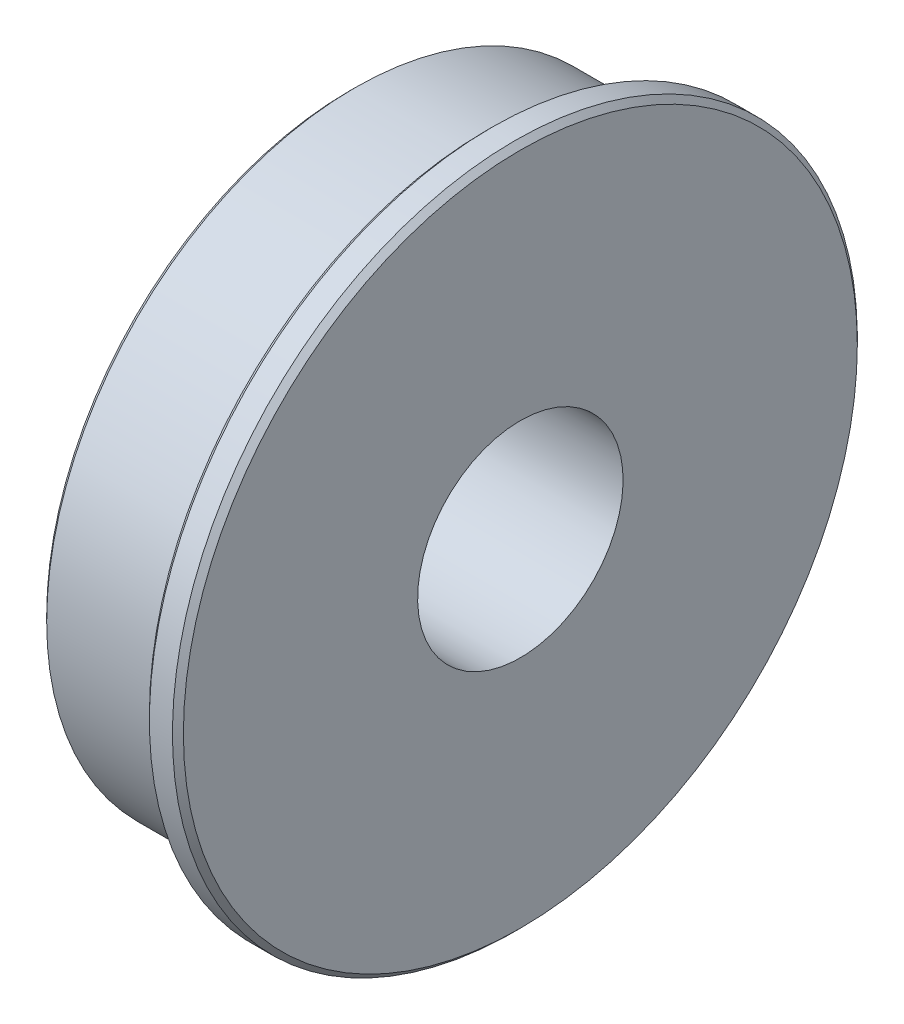
ISO-10303-21;
HEADER;
FILE_DESCRIPTION(('STEP AP214'),'2;1');
FILE_NAME('part.step','',(''),(''),'','','');
FILE_SCHEMA(('AUTOMOTIVE_DESIGN { 1 0 10303 214 1 1 1 1 }'));
ENDSEC;
DATA;
#1=APPLICATION_CONTEXT('core data for automotive mechanical design processes');
#2=APPLICATION_PROTOCOL_DEFINITION('international standard','automotive_design',2000,#1);
#3=PRODUCT_CONTEXT('',#1,'mechanical');
#4=PRODUCT('Part','Part','',(#3));
#5=PRODUCT_RELATED_PRODUCT_CATEGORY('part','',(#4));
#6=PRODUCT_DEFINITION_FORMATION('','',#4);
#7=PRODUCT_DEFINITION_CONTEXT('part definition',#1,'design');
#8=PRODUCT_DEFINITION('design','',#6,#7);
#9=PRODUCT_DEFINITION_SHAPE('','',#8);
#10=(LENGTH_UNIT() NAMED_UNIT(*) SI_UNIT(.MILLI.,.METRE.));
#11=(NAMED_UNIT(*) PLANE_ANGLE_UNIT() SI_UNIT($,.RADIAN.));
#12=(NAMED_UNIT(*) SI_UNIT($,.STERADIAN.) SOLID_ANGLE_UNIT());
#13=UNCERTAINTY_MEASURE_WITH_UNIT(LENGTH_MEASURE(1.E-05),#10,'distance_accuracy_value','');
#14=(GEOMETRIC_REPRESENTATION_CONTEXT(3) GLOBAL_UNCERTAINTY_ASSIGNED_CONTEXT((#13)) GLOBAL_UNIT_ASSIGNED_CONTEXT((#10,
#11,#12)) REPRESENTATION_CONTEXT('',''));
#15=CARTESIAN_POINT('',(0.,0.,0.));
#16=DIRECTION('',(0.,0.,1.));
#17=DIRECTION('',(1.,0.,0.));
#18=AXIS2_PLACEMENT_3D('',#15,#16,#17);
#19=CARTESIAN_POINT('',(3.9624,4.7625,0.));
#20=DIRECTION('',(1.,0.,0.));
#21=DIRECTION('',(0.,1.,0.));
#22=AXIS2_PLACEMENT_3D('',#19,#20,#21);
#23=PLANE('',#22);
#24=CARTESIAN_POINT('',(3.9624,0.,0.));
#25=DIRECTION('',(1.,0.,0.));
#26=DIRECTION('',(0.,1.,0.));
#27=AXIS2_PLACEMENT_3D('',#24,#25,#26);
#28=CIRCLE('',#27,15.621);
#29=CARTESIAN_POINT('',(3.96239999999999,15.621,0.));
#30=VERTEX_POINT('',#29);
#31=EDGE_CURVE('E53',#30,#30,#28,.T.);
#32=ORIENTED_EDGE('',*,*,#31,.T.);
#33=EDGE_LOOP('',(#32));
#34=FACE_BOUND('',#33,.T.);
#35=CARTESIAN_POINT('',(3.9624,0.,0.));
#36=DIRECTION('',(1.,0.,0.));
#37=DIRECTION('',(0.,1.,0.));
#38=AXIS2_PLACEMENT_3D('',#35,#36,#37);
#39=CIRCLE('',#38,4.7625);
#40=CARTESIAN_POINT('',(3.9624,4.7625,0.));
#41=VERTEX_POINT('',#40);
#42=EDGE_CURVE('E56',#41,#41,#39,.T.);
#43=ORIENTED_EDGE('',*,*,#42,.F.);
#44=EDGE_LOOP('',(#43));
#45=FACE_BOUND('',#44,.T.);
#46=ADVANCED_FACE('F30',(#34,#45),#23,.T.);
#47=CARTESIAN_POINT('',(3.9624,0.,0.));
#48=DIRECTION('',(1.,0.,0.));
#49=DIRECTION('',(0.,1.,0.));
#50=AXIS2_PLACEMENT_3D('',#47,#48,#49);
#51=CYLINDRICAL_SURFACE('',#50,4.7625);
#52=ORIENTED_EDGE('',*,*,#42,.T.);
#53=EDGE_LOOP('',(#52));
#54=FACE_BOUND('',#53,.T.);
#55=CARTESIAN_POINT('',(-3.9624,0.,0.));
#56=DIRECTION('',(1.,0.,0.));
#57=DIRECTION('',(0.,1.,0.));
#58=AXIS2_PLACEMENT_3D('',#55,#56,#57);
#59=CIRCLE('',#58,4.7625);
#60=CARTESIAN_POINT('',(-3.9624,4.7625,0.));
#61=VERTEX_POINT('',#60);
#62=EDGE_CURVE('E59',#61,#61,#59,.T.);
#63=ORIENTED_EDGE('',*,*,#62,.F.);
#64=EDGE_LOOP('',(#63));
#65=FACE_BOUND('',#64,.T.);
#66=ADVANCED_FACE('F79',(#54,#65),#51,.F.);
#67=CARTESIAN_POINT('',(-3.9624,14.2875,0.));
#68=DIRECTION('',(-1.,0.,0.));
#69=DIRECTION('',(0.,-1.,0.));
#70=AXIS2_PLACEMENT_3D('',#67,#68,#69);
#71=PLANE('',#70);
#72=CARTESIAN_POINT('',(-3.9624,0.,0.));
#73=DIRECTION('',(-1.,0.,0.));
#74=DIRECTION('',(0.,-1.,0.));
#75=AXIS2_PLACEMENT_3D('',#72,#73,#74);
#76=CIRCLE('',#75,14.0335);
#77=CARTESIAN_POINT('',(-3.96239999999999,-14.0335,0.));
#78=VERTEX_POINT('',#77);
#79=EDGE_CURVE('E10',#78,#78,#76,.T.);
#80=ORIENTED_EDGE('',*,*,#79,.T.);
#81=EDGE_LOOP('',(#80));
#82=FACE_BOUND('',#81,.T.);
#83=ORIENTED_EDGE('',*,*,#62,.T.);
#84=EDGE_LOOP('',(#83));
#85=FACE_BOUND('',#84,.T.);
#86=ADVANCED_FACE('F70',(#82,#85),#71,.T.);
#87=CARTESIAN_POINT('',(3.9624,0.,0.));
#88=DIRECTION('',(1.,0.,0.));
#89=DIRECTION('',(0.,1.,0.));
#90=AXIS2_PLACEMENT_3D('',#87,#88,#89);
#91=CYLINDRICAL_SURFACE('',#90,14.2875);
#92=CARTESIAN_POINT('',(-3.70839999999999,0.,0.));
#93=DIRECTION('',(-1.,0.,0.));
#94=DIRECTION('',(0.,-1.,0.));
#95=AXIS2_PLACEMENT_3D('',#92,#93,#94);
#96=CIRCLE('',#95,14.2875);
#97=CARTESIAN_POINT('',(-3.70839999999999,-14.2875,0.));
#98=VERTEX_POINT('',#97);
#99=EDGE_CURVE('E37',#98,#98,#96,.F.);
#100=ORIENTED_EDGE('',*,*,#99,.T.);
#101=EDGE_LOOP('',(#100));
#102=FACE_BOUND('',#101,.T.);
#103=CARTESIAN_POINT('',(2.3876,0.,0.));
#104=DIRECTION('',(1.,0.,0.));
#105=DIRECTION('',(0.,1.,0.));
#106=AXIS2_PLACEMENT_3D('',#103,#104,#105);
#107=CIRCLE('',#106,14.2875);
#108=CARTESIAN_POINT('',(2.38759999999999,14.2875,0.));
#109=VERTEX_POINT('',#108);
#110=EDGE_CURVE('E62',#109,#109,#107,.T.);
#111=ORIENTED_EDGE('',*,*,#110,.F.);
#112=EDGE_LOOP('',(#111));
#113=FACE_BOUND('',#112,.T.);
#114=ADVANCED_FACE('F68',(#102,#113),#91,.T.);
#115=CARTESIAN_POINT('',(2.38759999999999,14.2875,0.));
#116=DIRECTION('',(-1.,0.,0.));
#117=DIRECTION('',(0.,-1.,0.));
#118=AXIS2_PLACEMENT_3D('',#115,#116,#117);
#119=PLANE('',#118);
#120=CARTESIAN_POINT('',(2.3876,0.,0.));
#121=DIRECTION('',(-1.,0.,0.));
#122=DIRECTION('',(0.,-1.,0.));
#123=AXIS2_PLACEMENT_3D('',#120,#121,#122);
#124=CIRCLE('',#123,15.621);
#125=CARTESIAN_POINT('',(2.3876,-15.621,0.));
#126=VERTEX_POINT('',#125);
#127=EDGE_CURVE('E41',#126,#126,#124,.T.);
#128=ORIENTED_EDGE('',*,*,#127,.T.);
#129=EDGE_LOOP('',(#128));
#130=FACE_BOUND('',#129,.T.);
#131=ORIENTED_EDGE('',*,*,#110,.T.);
#132=EDGE_LOOP('',(#131));
#133=FACE_BOUND('',#132,.T.);
#134=ADVANCED_FACE('F66',(#130,#133),#119,.T.);
#135=CARTESIAN_POINT('',(3.9624,0.,0.));
#136=DIRECTION('',(1.,0.,0.));
#137=DIRECTION('',(0.,1.,0.));
#138=AXIS2_PLACEMENT_3D('',#135,#136,#137);
#139=CYLINDRICAL_SURFACE('',#138,15.875);
#140=CARTESIAN_POINT('',(3.7084,0.,0.));
#141=DIRECTION('',(1.,0.,0.));
#142=DIRECTION('',(0.,1.,0.));
#143=AXIS2_PLACEMENT_3D('',#140,#141,#142);
#144=CIRCLE('',#143,15.875);
#145=CARTESIAN_POINT('',(3.7084,15.875,0.));
#146=VERTEX_POINT('',#145);
#147=EDGE_CURVE('E45',#146,#146,#144,.F.);
#148=ORIENTED_EDGE('',*,*,#147,.T.);
#149=EDGE_LOOP('',(#148));
#150=FACE_BOUND('',#149,.T.);
#151=CARTESIAN_POINT('',(2.6416,0.,0.));
#152=DIRECTION('',(-1.,0.,0.));
#153=DIRECTION('',(0.,-1.,0.));
#154=AXIS2_PLACEMENT_3D('',#151,#152,#153);
#155=CIRCLE('',#154,15.875);
#156=CARTESIAN_POINT('',(2.64160000000001,-15.875,0.));
#157=VERTEX_POINT('',#156);
#158=EDGE_CURVE('E50',#157,#157,#155,.F.);
#159=ORIENTED_EDGE('',*,*,#158,.T.);
#160=EDGE_LOOP('',(#159));
#161=FACE_BOUND('',#160,.T.);
#162=ADVANCED_FACE('F76',(#150,#161),#139,.T.);
#163=CARTESIAN_POINT('',(3.9624,0.,0.));
#164=DIRECTION('',(-1.,0.,0.));
#165=DIRECTION('',(0.,-1.,0.));
#166=AXIS2_PLACEMENT_3D('',#163,#164,#165);
#167=CONICAL_SURFACE('',#166,15.621,0.785398163397447);
#168=ORIENTED_EDGE('',*,*,#147,.F.);
#169=EDGE_LOOP('',(#168));
#170=FACE_BOUND('',#169,.T.);
#171=ORIENTED_EDGE('',*,*,#31,.F.);
#172=EDGE_LOOP('',(#171));
#173=FACE_BOUND('',#172,.T.);
#174=ADVANCED_FACE('F91',(#170,#173),#167,.T.);
#175=CARTESIAN_POINT('',(2.6416,0.,0.));
#176=DIRECTION('',(1.,0.,0.));
#177=DIRECTION('',(0.,1.,0.));
#178=AXIS2_PLACEMENT_3D('',#175,#176,#177);
#179=CONICAL_SURFACE('',#178,15.875,0.785398163397448);
#180=ORIENTED_EDGE('',*,*,#127,.F.);
#181=EDGE_LOOP('',(#180));
#182=FACE_BOUND('',#181,.T.);
#183=ORIENTED_EDGE('',*,*,#158,.F.);
#184=EDGE_LOOP('',(#183));
#185=FACE_BOUND('',#184,.T.);
#186=ADVANCED_FACE('F93',(#182,#185),#179,.T.);
#187=CARTESIAN_POINT('',(-3.70839999999999,0.,0.));
#188=DIRECTION('',(1.,0.,0.));
#189=DIRECTION('',(0.,1.,0.));
#190=AXIS2_PLACEMENT_3D('',#187,#188,#189);
#191=CONICAL_SURFACE('',#190,14.2875,0.78539816339745);
#192=ORIENTED_EDGE('',*,*,#79,.F.);
#193=EDGE_LOOP('',(#192));
#194=FACE_BOUND('',#193,.T.);
#195=ORIENTED_EDGE('',*,*,#99,.F.);
#196=EDGE_LOOP('',(#195));
#197=FACE_BOUND('',#196,.T.);
#198=ADVANCED_FACE('F32',(#194,#197),#191,.T.);
#199=CLOSED_SHELL('',(#46,#66,#86,#114,#134,#162,#174,#186,#198));
#200=MANIFOLD_SOLID_BREP('B2',#199);
#201=ADVANCED_BREP_SHAPE_REPRESENTATION('',(#18,#200),#14);
#202=SHAPE_DEFINITION_REPRESENTATION(#9,#201);
ENDSEC;
END-ISO-10303-21;
